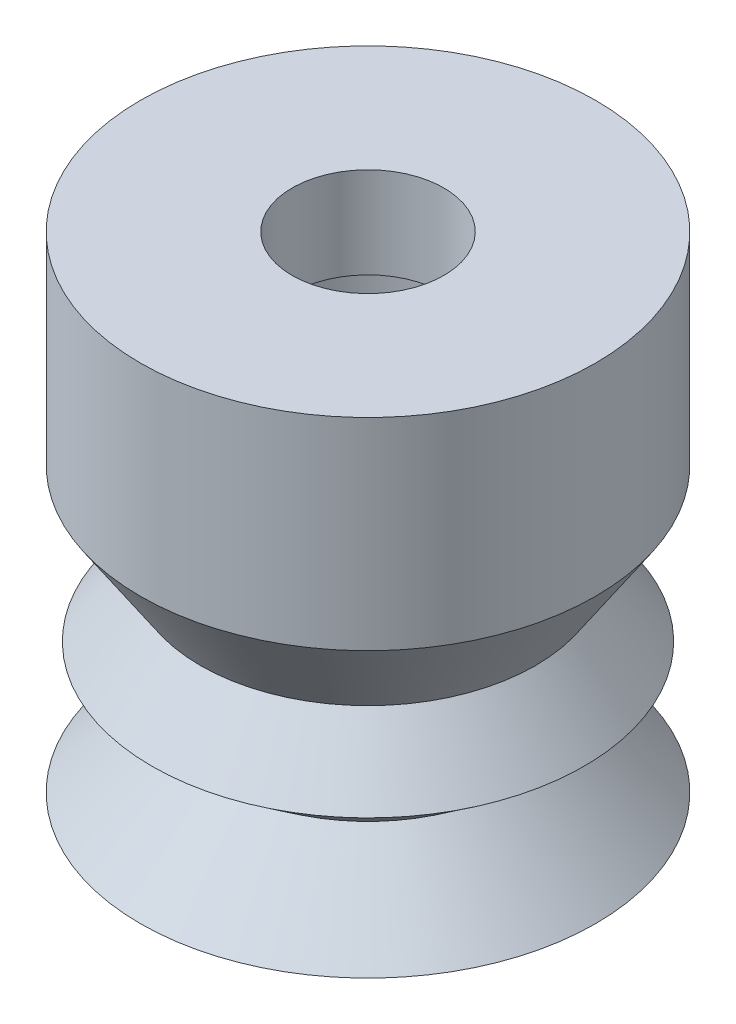
ISO-10303-21;
HEADER;
FILE_DESCRIPTION(('STEP AP214'),'2;1');
FILE_NAME('part.step','',(''),(''),'','','');
FILE_SCHEMA(('AUTOMOTIVE_DESIGN { 1 0 10303 214 1 1 1 1 }'));
ENDSEC;
DATA;
#1=APPLICATION_CONTEXT('core data for automotive mechanical design processes');
#2=APPLICATION_PROTOCOL_DEFINITION('international standard','automotive_design',2000,#1);
#3=PRODUCT_CONTEXT('',#1,'mechanical');
#4=PRODUCT('Part','Part','',(#3));
#5=PRODUCT_RELATED_PRODUCT_CATEGORY('part','',(#4));
#6=PRODUCT_DEFINITION_FORMATION('','',#4);
#7=PRODUCT_DEFINITION_CONTEXT('part definition',#1,'design');
#8=PRODUCT_DEFINITION('design','',#6,#7);
#9=PRODUCT_DEFINITION_SHAPE('','',#8);
#10=(LENGTH_UNIT() NAMED_UNIT(*) SI_UNIT(.MILLI.,.METRE.));
#11=(NAMED_UNIT(*) PLANE_ANGLE_UNIT() SI_UNIT($,.RADIAN.));
#12=(NAMED_UNIT(*) SI_UNIT($,.STERADIAN.) SOLID_ANGLE_UNIT());
#13=UNCERTAINTY_MEASURE_WITH_UNIT(LENGTH_MEASURE(1.E-05),#10,'distance_accuracy_value','');
#14=(GEOMETRIC_REPRESENTATION_CONTEXT(3) GLOBAL_UNCERTAINTY_ASSIGNED_CONTEXT((#13)) GLOBAL_UNIT_ASSIGNED_CONTEXT((#10,
#11,#12)) REPRESENTATION_CONTEXT('',''));
#15=CARTESIAN_POINT('',(0.,0.,0.));
#16=DIRECTION('',(0.,0.,1.));
#17=DIRECTION('',(1.,0.,0.));
#18=AXIS2_PLACEMENT_3D('',#15,#16,#17);
#19=CARTESIAN_POINT('',(0.,-9.62557017547921,0.));
#20=DIRECTION('',(0.,-1.,0.));
#21=DIRECTION('',(0.,0.,-1.));
#22=AXIS2_PLACEMENT_3D('',#19,#20,#21);
#23=CONICAL_SURFACE('',#22,5.51879532314865,0.659302510509545);
#24=CARTESIAN_POINT('',(0.,-11.6946644151339,0.));
#25=DIRECTION('',(0.,1.,0.));
#26=DIRECTION('',(0.,0.,1.));
#27=AXIS2_PLACEMENT_3D('',#24,#25,#26);
#28=CIRCLE('',#27,7.12231832869608);
#29=CARTESIAN_POINT('',(0.,-11.6946644151339,7.12231832869608));
#30=VERTEX_POINT('',#29);
#31=EDGE_CURVE('E10',#30,#30,#28,.T.);
#32=ORIENTED_EDGE('',*,*,#31,.T.);
#33=EDGE_LOOP('',(#32));
#34=FACE_BOUND('',#33,.T.);
#35=CARTESIAN_POINT('',(0.,-9.62557017547921,0.));
#36=DIRECTION('',(0.,1.,0.));
#37=DIRECTION('',(0.,0.,1.));
#38=AXIS2_PLACEMENT_3D('',#35,#36,#37);
#39=CIRCLE('',#38,5.51879532314865);
#40=CARTESIAN_POINT('',(0.,-9.62557017547921,5.51879532314865));
#41=VERTEX_POINT('',#40);
#42=EDGE_CURVE('E83',#41,#41,#39,.T.);
#43=ORIENTED_EDGE('',*,*,#42,.F.);
#44=EDGE_LOOP('',(#43));
#45=FACE_BOUND('',#44,.T.);
#46=ADVANCED_FACE('F37',(#34,#45),#23,.T.);
#47=CARTESIAN_POINT('',(0.,-11.6946644151339,0.));
#48=DIRECTION('',(0.,1.,0.));
#49=DIRECTION('',(0.,0.,1.));
#50=AXIS2_PLACEMENT_3D('',#47,#48,#49);
#51=CONICAL_SURFACE('',#50,7.12231832869608,0.925862101294255);
#52=CARTESIAN_POINT('',(0.,-13.3893511257082,0.));
#53=DIRECTION('',(0.,1.,0.));
#54=DIRECTION('',(0.,0.,1.));
#55=AXIS2_PLACEMENT_3D('',#52,#53,#54);
#56=CIRCLE('',#55,4.86946953004879);
#57=CARTESIAN_POINT('',(0.,-13.3893511257082,4.86946953004879));
#58=VERTEX_POINT('',#57);
#59=EDGE_CURVE('E43',#58,#58,#56,.T.);
#60=ORIENTED_EDGE('',*,*,#59,.T.);
#61=EDGE_LOOP('',(#60));
#62=FACE_BOUND('',#61,.T.);
#63=ORIENTED_EDGE('',*,*,#31,.F.);
#64=EDGE_LOOP('',(#63));
#65=FACE_BOUND('',#64,.T.);
#66=ADVANCED_FACE('F91',(#62,#65),#51,.T.);
#67=CARTESIAN_POINT('',(0.,-13.3893511257082,0.));
#68=DIRECTION('',(0.,-1.,0.));
#69=DIRECTION('',(0.,0.,-1.));
#70=AXIS2_PLACEMENT_3D('',#67,#68,#69);
#71=CONICAL_SURFACE('',#70,4.86946953004879,0.789191489096226);
#72=CARTESIAN_POINT('',(0.,-16.,0.));
#73=DIRECTION('',(0.,1.,0.));
#74=DIRECTION('',(0.,0.,1.));
#75=AXIS2_PLACEMENT_3D('',#72,#73,#74);
#76=CIRCLE('',#75,7.5);
#77=CARTESIAN_POINT('',(0.,-16.,7.5));
#78=VERTEX_POINT('',#77);
#79=EDGE_CURVE('E47',#78,#78,#76,.T.);
#80=ORIENTED_EDGE('',*,*,#79,.T.);
#81=EDGE_LOOP('',(#80));
#82=FACE_BOUND('',#81,.T.);
#83=ORIENTED_EDGE('',*,*,#59,.F.);
#84=EDGE_LOOP('',(#83));
#85=FACE_BOUND('',#84,.T.);
#86=ADVANCED_FACE('F95',(#82,#85),#71,.T.);
#87=CARTESIAN_POINT('',(0.,-16.,0.));
#88=DIRECTION('',(0.,-1.,0.));
#89=DIRECTION('',(0.,0.,-1.));
#90=AXIS2_PLACEMENT_3D('',#87,#88,#89);
#91=CONICAL_SURFACE('',#90,7.5,0.992551875358977);
#92=CARTESIAN_POINT('',(0.,-13.3893511257082,0.));
#93=DIRECTION('',(0.,1.,0.));
#94=DIRECTION('',(0.,0.,1.));
#95=AXIS2_PLACEMENT_3D('',#92,#93,#94);
#96=CIRCLE('',#95,3.5);
#97=CARTESIAN_POINT('',(0.,-13.3893511257082,3.5));
#98=VERTEX_POINT('',#97);
#99=EDGE_CURVE('E51',#98,#98,#96,.T.);
#100=ORIENTED_EDGE('',*,*,#99,.T.);
#101=EDGE_LOOP('',(#100));
#102=FACE_BOUND('',#101,.T.);
#103=ORIENTED_EDGE('',*,*,#79,.F.);
#104=EDGE_LOOP('',(#103));
#105=FACE_BOUND('',#104,.T.);
#106=ADVANCED_FACE('F99',(#102,#105),#91,.F.);
#107=CARTESIAN_POINT('',(0.,-13.3893511257082,0.));
#108=DIRECTION('',(0.,1.,0.));
#109=DIRECTION('',(0.,0.,1.));
#110=AXIS2_PLACEMENT_3D('',#107,#108,#109);
#111=CONICAL_SURFACE('',#110,3.5,0.934876396265035);
#112=CARTESIAN_POINT('',(0.,-11.6946644151339,0.));
#113=DIRECTION('',(0.,1.,0.));
#114=DIRECTION('',(0.,0.,1.));
#115=AXIS2_PLACEMENT_3D('',#112,#113,#114);
#116=CIRCLE('',#115,5.79563552303707);
#117=CARTESIAN_POINT('',(0.,-11.6946644151339,5.79563552303707));
#118=VERTEX_POINT('',#117);
#119=EDGE_CURVE('E56',#118,#118,#116,.T.);
#120=ORIENTED_EDGE('',*,*,#119,.T.);
#121=EDGE_LOOP('',(#120));
#122=FACE_BOUND('',#121,.T.);
#123=ORIENTED_EDGE('',*,*,#99,.F.);
#124=EDGE_LOOP('',(#123));
#125=FACE_BOUND('',#124,.T.);
#126=ADVANCED_FACE('F106',(#122,#125),#111,.F.);
#127=CARTESIAN_POINT('',(0.,-11.6946644151339,0.));
#128=DIRECTION('',(0.,-1.,0.));
#129=DIRECTION('',(0.,0.,-1.));
#130=AXIS2_PLACEMENT_3D('',#127,#128,#129);
#131=CONICAL_SURFACE('',#130,5.79563552303707,1.07170394104994);
#132=CARTESIAN_POINT('',(0.,-9.62557017547921,0.));
#133=DIRECTION('',(0.,1.,0.));
#134=DIRECTION('',(0.,0.,1.));
#135=AXIS2_PLACEMENT_3D('',#132,#133,#134);
#136=CIRCLE('',#135,2.);
#137=CARTESIAN_POINT('',(0.,-9.62557017547921,2.));
#138=VERTEX_POINT('',#137);
#139=EDGE_CURVE('E59',#138,#138,#136,.T.);
#140=ORIENTED_EDGE('',*,*,#139,.T.);
#141=EDGE_LOOP('',(#140));
#142=FACE_BOUND('',#141,.T.);
#143=ORIENTED_EDGE('',*,*,#119,.F.);
#144=EDGE_LOOP('',(#143));
#145=FACE_BOUND('',#144,.T.);
#146=ADVANCED_FACE('F110',(#142,#145),#131,.F.);
#147=CARTESIAN_POINT('',(0.,0.,0.));
#148=DIRECTION('',(0.,1.,0.));
#149=DIRECTION('',(0.,0.,1.));
#150=AXIS2_PLACEMENT_3D('',#147,#148,#149);
#151=CYLINDRICAL_SURFACE('',#150,2.);
#152=CARTESIAN_POINT('',(0.,-5.,0.));
#153=DIRECTION('',(0.,1.,0.));
#154=DIRECTION('',(0.,0.,1.));
#155=AXIS2_PLACEMENT_3D('',#152,#153,#154);
#156=CIRCLE('',#155,2.);
#157=CARTESIAN_POINT('',(0.,-5.,2.));
#158=VERTEX_POINT('',#157);
#159=EDGE_CURVE('E62',#158,#158,#156,.T.);
#160=ORIENTED_EDGE('',*,*,#159,.T.);
#161=EDGE_LOOP('',(#160));
#162=FACE_BOUND('',#161,.T.);
#163=ORIENTED_EDGE('',*,*,#139,.F.);
#164=EDGE_LOOP('',(#163));
#165=FACE_BOUND('',#164,.T.);
#166=ADVANCED_FACE('F114',(#162,#165),#151,.F.);
#167=CARTESIAN_POINT('',(-3.5,-5.,0.));
#168=DIRECTION('',(0.,1.,0.));
#169=DIRECTION('',(0.,0.,1.));
#170=AXIS2_PLACEMENT_3D('',#167,#168,#169);
#171=PLANE('',#170);
#172=CARTESIAN_POINT('',(0.,-5.,0.));
#173=DIRECTION('',(0.,1.,0.));
#174=DIRECTION('',(0.,0.,1.));
#175=AXIS2_PLACEMENT_3D('',#172,#173,#174);
#176=CIRCLE('',#175,3.5);
#177=CARTESIAN_POINT('',(0.,-5.,3.5));
#178=VERTEX_POINT('',#177);
#179=EDGE_CURVE('E65',#178,#178,#176,.T.);
#180=ORIENTED_EDGE('',*,*,#179,.T.);
#181=EDGE_LOOP('',(#180));
#182=FACE_BOUND('',#181,.T.);
#183=ORIENTED_EDGE('',*,*,#159,.F.);
#184=EDGE_LOOP('',(#183));
#185=FACE_BOUND('',#184,.T.);
#186=ADVANCED_FACE('F118',(#182,#185),#171,.T.);
#187=CARTESIAN_POINT('',(0.,0.,0.));
#188=DIRECTION('',(0.,1.,0.));
#189=DIRECTION('',(0.,0.,1.));
#190=AXIS2_PLACEMENT_3D('',#187,#188,#189);
#191=CYLINDRICAL_SURFACE('',#190,3.5);
#192=CARTESIAN_POINT('',(0.,-3.,0.));
#193=DIRECTION('',(0.,1.,0.));
#194=DIRECTION('',(0.,0.,1.));
#195=AXIS2_PLACEMENT_3D('',#192,#193,#194);
#196=CIRCLE('',#195,3.5);
#197=CARTESIAN_POINT('',(0.,-3.,3.5));
#198=VERTEX_POINT('',#197);
#199=EDGE_CURVE('E68',#198,#198,#196,.T.);
#200=ORIENTED_EDGE('',*,*,#199,.T.);
#201=EDGE_LOOP('',(#200));
#202=FACE_BOUND('',#201,.T.);
#203=ORIENTED_EDGE('',*,*,#179,.F.);
#204=EDGE_LOOP('',(#203));
#205=FACE_BOUND('',#204,.T.);
#206=ADVANCED_FACE('F122',(#202,#205),#191,.F.);
#207=CARTESIAN_POINT('',(-2.5,-3.,0.));
#208=DIRECTION('',(0.,-1.,0.));
#209=DIRECTION('',(0.,0.,-1.));
#210=AXIS2_PLACEMENT_3D('',#207,#208,#209);
#211=PLANE('',#210);
#212=CARTESIAN_POINT('',(0.,-3.,0.));
#213=DIRECTION('',(0.,1.,0.));
#214=DIRECTION('',(0.,0.,1.));
#215=AXIS2_PLACEMENT_3D('',#212,#213,#214);
#216=CIRCLE('',#215,2.5);
#217=CARTESIAN_POINT('',(0.,-3.,2.5));
#218=VERTEX_POINT('',#217);
#219=EDGE_CURVE('E71',#218,#218,#216,.T.);
#220=ORIENTED_EDGE('',*,*,#219,.T.);
#221=EDGE_LOOP('',(#220));
#222=FACE_BOUND('',#221,.T.);
#223=ORIENTED_EDGE('',*,*,#199,.F.);
#224=EDGE_LOOP('',(#223));
#225=FACE_BOUND('',#224,.T.);
#226=ADVANCED_FACE('F126',(#222,#225),#211,.T.);
#227=CARTESIAN_POINT('',(0.,0.,0.));
#228=DIRECTION('',(0.,1.,0.));
#229=DIRECTION('',(0.,0.,1.));
#230=AXIS2_PLACEMENT_3D('',#227,#228,#229);
#231=CYLINDRICAL_SURFACE('',#230,2.5);
#232=CARTESIAN_POINT('',(0.,0.,0.));
#233=DIRECTION('',(0.,1.,0.));
#234=DIRECTION('',(0.,0.,1.));
#235=AXIS2_PLACEMENT_3D('',#232,#233,#234);
#236=CIRCLE('',#235,2.5);
#237=CARTESIAN_POINT('',(0.,0.,2.5));
#238=VERTEX_POINT('',#237);
#239=EDGE_CURVE('E74',#238,#238,#236,.T.);
#240=ORIENTED_EDGE('',*,*,#239,.T.);
#241=EDGE_LOOP('',(#240));
#242=FACE_BOUND('',#241,.T.);
#243=ORIENTED_EDGE('',*,*,#219,.F.);
#244=EDGE_LOOP('',(#243));
#245=FACE_BOUND('',#244,.T.);
#246=ADVANCED_FACE('F130',(#242,#245),#231,.F.);
#247=CARTESIAN_POINT('',(-2.5,0.,0.));
#248=DIRECTION('',(0.,1.,0.));
#249=DIRECTION('',(0.,0.,1.));
#250=AXIS2_PLACEMENT_3D('',#247,#248,#249);
#251=PLANE('',#250);
#252=CARTESIAN_POINT('',(0.,0.,0.));
#253=DIRECTION('',(0.,1.,0.));
#254=DIRECTION('',(0.,0.,1.));
#255=AXIS2_PLACEMENT_3D('',#252,#253,#254);
#256=CIRCLE('',#255,7.5);
#257=CARTESIAN_POINT('',(0.,0.,7.5));
#258=VERTEX_POINT('',#257);
#259=EDGE_CURVE('E77',#258,#258,#256,.T.);
#260=ORIENTED_EDGE('',*,*,#259,.T.);
#261=EDGE_LOOP('',(#260));
#262=FACE_BOUND('',#261,.T.);
#263=ORIENTED_EDGE('',*,*,#239,.F.);
#264=EDGE_LOOP('',(#263));
#265=FACE_BOUND('',#264,.T.);
#266=ADVANCED_FACE('F134',(#262,#265),#251,.T.);
#267=CARTESIAN_POINT('',(0.,0.,0.));
#268=DIRECTION('',(0.,1.,0.));
#269=DIRECTION('',(0.,0.,1.));
#270=AXIS2_PLACEMENT_3D('',#267,#268,#269);
#271=CYLINDRICAL_SURFACE('',#270,7.5);
#272=CARTESIAN_POINT('',(0.,-6.65629747166744,0.));
#273=DIRECTION('',(0.,1.,0.));
#274=DIRECTION('',(0.,0.,1.));
#275=AXIS2_PLACEMENT_3D('',#272,#273,#274);
#276=CIRCLE('',#275,7.5);
#277=CARTESIAN_POINT('',(0.,-6.65629747166744,7.5));
#278=VERTEX_POINT('',#277);
#279=EDGE_CURVE('E80',#278,#278,#276,.T.);
#280=ORIENTED_EDGE('',*,*,#279,.T.);
#281=EDGE_LOOP('',(#280));
#282=FACE_BOUND('',#281,.T.);
#283=ORIENTED_EDGE('',*,*,#259,.F.);
#284=EDGE_LOOP('',(#283));
#285=FACE_BOUND('',#284,.T.);
#286=ADVANCED_FACE('F138',(#282,#285),#271,.T.);
#287=CARTESIAN_POINT('',(0.,-6.65629747166744,0.));
#288=DIRECTION('',(0.,1.,0.));
#289=DIRECTION('',(0.,0.,1.));
#290=AXIS2_PLACEMENT_3D('',#287,#288,#289);
#291=CONICAL_SURFACE('',#290,7.5,0.588396428962246);
#292=ORIENTED_EDGE('',*,*,#42,.T.);
#293=EDGE_LOOP('',(#292));
#294=FACE_BOUND('',#293,.T.);
#295=ORIENTED_EDGE('',*,*,#279,.F.);
#296=EDGE_LOOP('',(#295));
#297=FACE_BOUND('',#296,.T.);
#298=ADVANCED_FACE('F87',(#294,#297),#291,.T.);
#299=CLOSED_SHELL('',(#46,#66,#86,#106,#126,#146,#166,#186,#206,#226,#246,#266,#286,#298));
#300=MANIFOLD_SOLID_BREP('B2',#299);
#301=ADVANCED_BREP_SHAPE_REPRESENTATION('',(#18,#300),#14);
#302=SHAPE_DEFINITION_REPRESENTATION(#9,#301);
ENDSEC;
END-ISO-10303-21;
